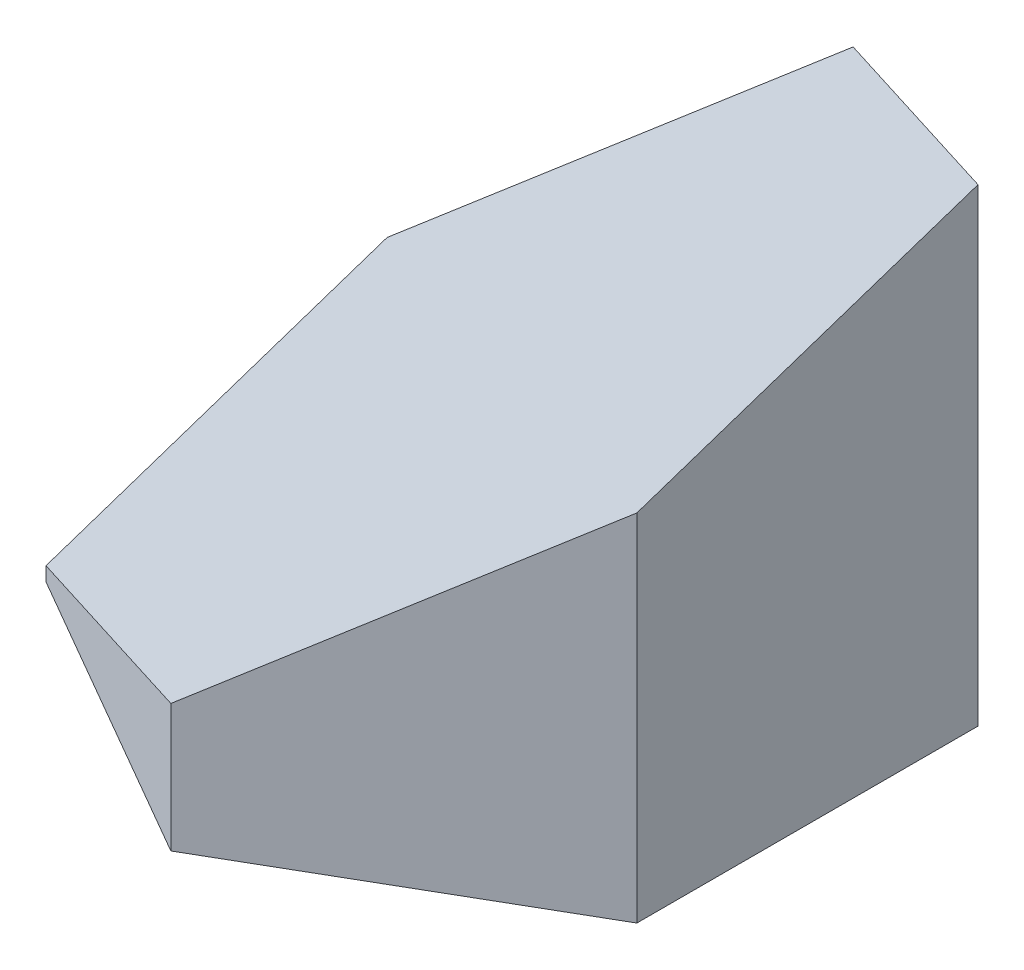
ISO-10303-21;
HEADER;
FILE_DESCRIPTION(('STEP AP214'),'2;1');
FILE_NAME('part.step','',(''),(''),'','','');
FILE_SCHEMA(('AUTOMOTIVE_DESIGN { 1 0 10303 214 1 1 1 1 }'));
ENDSEC;
DATA;
#1=APPLICATION_CONTEXT('core data for automotive mechanical design processes');
#2=APPLICATION_PROTOCOL_DEFINITION('international standard','automotive_design',2000,#1);
#3=PRODUCT_CONTEXT('',#1,'mechanical');
#4=PRODUCT('Part','Part','',(#3));
#5=PRODUCT_RELATED_PRODUCT_CATEGORY('part','',(#4));
#6=PRODUCT_DEFINITION_FORMATION('','',#4);
#7=PRODUCT_DEFINITION_CONTEXT('part definition',#1,'design');
#8=PRODUCT_DEFINITION('design','',#6,#7);
#9=PRODUCT_DEFINITION_SHAPE('','',#8);
#10=(LENGTH_UNIT() NAMED_UNIT(*) SI_UNIT(.MILLI.,.METRE.));
#11=(NAMED_UNIT(*) PLANE_ANGLE_UNIT() SI_UNIT($,.RADIAN.));
#12=(NAMED_UNIT(*) SI_UNIT($,.STERADIAN.) SOLID_ANGLE_UNIT());
#13=UNCERTAINTY_MEASURE_WITH_UNIT(LENGTH_MEASURE(1.E-05),#10,'distance_accuracy_value','');
#14=(GEOMETRIC_REPRESENTATION_CONTEXT(3) GLOBAL_UNCERTAINTY_ASSIGNED_CONTEXT((#13)) GLOBAL_UNIT_ASSIGNED_CONTEXT((#10,
#11,#12)) REPRESENTATION_CONTEXT('',''));
#15=CARTESIAN_POINT('',(0.,0.,0.));
#16=DIRECTION('',(0.,0.,1.));
#17=DIRECTION('',(1.,0.,0.));
#18=AXIS2_PLACEMENT_3D('',#15,#16,#17);
#19=CARTESIAN_POINT('',(0.,0.,0.));
#20=DIRECTION('',(0.480384461415263,-0.832050294337843,-0.277350098112614));
#21=DIRECTION('',(0.866025403784438,0.500000000000001,0.));
#22=AXIS2_PLACEMENT_3D('',#19,#20,#21);
#23=PLANE('',#22);
#24=DIRECTION('',(-0.72057669212289,-0.55470019622523,0.416025147168924));
#25=VECTOR('',#24,1.);
#26=CARTESIAN_POINT('',(109.626508050868,38.0636045401386,75.6878681800464));
#27=LINE('',#26,#25);
#28=CARTESIAN_POINT('',(114.282032302755,41.6474287801999,73.0000000000004));
#29=VERTEX_POINT('',#28);
#30=CARTESIAN_POINT('',(79.6410161513778,14.9807621135334,93.0000000000003));
#31=VERTEX_POINT('',#30);
#32=EDGE_CURVE('E87',#29,#31,#27,.T.);
#33=ORIENTED_EDGE('',*,*,#32,.F.);
#34=DIRECTION('',(0.,-0.316227766016837,0.948683298050514));
#35=VECTOR('',#34,1.);
#36=CARTESIAN_POINT('',(114.282032302755,46.4826859021799,58.4942286340604));
#37=LINE('',#36,#35);
#38=CARTESIAN_POINT('',(114.282032302755,54.9807621135333,33.));
#39=VERTEX_POINT('',#38);
#40=EDGE_CURVE('E93',#39,#29,#37,.T.);
#41=ORIENTED_EDGE('',*,*,#40,.F.);
#42=DIRECTION('',(0.821583836257748,0.316227766016838,0.474341649025259));
#43=VECTOR('',#42,1.);
#44=CARTESIAN_POINT('',(123.38029719201,58.48268590218,38.2528856829701));
#45=LINE('',#44,#43);
#46=CARTESIAN_POINT('',(79.6410161513775,41.6474287802,13.));
#47=VERTEX_POINT('',#46);
#48=EDGE_CURVE('E143',#47,#39,#45,.T.);
#49=ORIENTED_EDGE('',*,*,#48,.F.);
#50=DIRECTION('',(0.720576692122891,0.55470019622523,-0.416025147168922));
#51=VECTOR('',#50,1.);
#52=CARTESIAN_POINT('',(98.9677338504436,56.525143001677,1.84171433389228));
#53=LINE('',#52,#51);
#54=CARTESIAN_POINT('',(45.,14.9807621135333,33.));
#55=VERTEX_POINT('',#54);
#56=EDGE_CURVE('E139',#55,#47,#53,.T.);
#57=ORIENTED_EDGE('',*,*,#56,.F.);
#58=DIRECTION('',(0.,0.316227766016837,-0.948683298050514));
#59=VECTOR('',#58,1.);
#60=CARTESIAN_POINT('',(45.,22.4826859021799,10.4942286340601));
#61=LINE('',#60,#59);
#62=CARTESIAN_POINT('',(45.,1.64742878019996,73.0000000000001));
#63=VERTEX_POINT('',#62);
#64=EDGE_CURVE('E51',#63,#55,#61,.T.);
#65=ORIENTED_EDGE('',*,*,#64,.F.);
#66=DIRECTION('',(-0.821583836257748,-0.316227766016839,-0.474341649025259));
#67=VECTOR('',#66,1.);
#68=CARTESIAN_POINT('',(67.9546713498062,10.48268590218,86.2528856829702));
#69=LINE('',#68,#67);
#70=EDGE_CURVE('E12',#31,#63,#69,.T.);
#71=ORIENTED_EDGE('',*,*,#70,.F.);
#72=EDGE_LOOP('',(#33,#41,#49,#57,#65,#71));
#73=FACE_BOUND('',#72,.T.);
#74=ADVANCED_FACE('F36',(#73),#23,.F.);
#75=CARTESIAN_POINT('',(79.6410161513778,90.,93.0000000000003));
#76=DIRECTION('',(-0.500000000000002,0.,-0.866025403784437));
#77=DIRECTION('',(-0.866025403784437,0.,0.500000000000003));
#78=AXIS2_PLACEMENT_3D('',#75,#76,#77);
#79=PLANE('',#78);
#80=DIRECTION('',(0.,-1.,0.));
#81=VECTOR('',#80,1.);
#82=CARTESIAN_POINT('',(114.282032302755,90.,73.0000000000004));
#83=LINE('',#82,#81);
#84=CARTESIAN_POINT('',(114.282032302755,0.,73.0000000000004));
#85=VERTEX_POINT('',#84);
#86=EDGE_CURVE('E44',#29,#85,#83,.T.);
#87=ORIENTED_EDGE('',*,*,#86,.F.);
#88=ORIENTED_EDGE('',*,*,#32,.T.);
#89=DIRECTION('',(0.,-1.,0.));
#90=VECTOR('',#89,1.);
#91=CARTESIAN_POINT('',(79.6410161513778,90.,93.0000000000003));
#92=LINE('',#91,#90);
#93=CARTESIAN_POINT('',(79.6410161513778,0.,93.0000000000003));
#94=VERTEX_POINT('',#93);
#95=EDGE_CURVE('E58',#31,#94,#92,.T.);
#96=ORIENTED_EDGE('',*,*,#95,.T.);
#97=DIRECTION('',(0.866025403784437,0.,-0.500000000000002));
#98=VECTOR('',#97,1.);
#99=CARTESIAN_POINT('',(79.6410161513778,0.,93.0000000000003));
#100=LINE('',#99,#98);
#101=EDGE_CURVE('E92',#94,#85,#100,.T.);
#102=ORIENTED_EDGE('',*,*,#101,.T.);
#103=EDGE_LOOP('',(#87,#88,#96,#102));
#104=FACE_BOUND('',#103,.T.);
#105=ADVANCED_FACE('F38',(#104),#79,.F.);
#106=CARTESIAN_POINT('',(114.282032302755,90.,73.0000000000004));
#107=DIRECTION('',(-1.,0.,0.));
#108=DIRECTION('',(0.,0.,1.));
#109=AXIS2_PLACEMENT_3D('',#106,#107,#108);
#110=PLANE('',#109);
#111=DIRECTION('',(0.,-1.,0.));
#112=VECTOR('',#111,1.);
#113=CARTESIAN_POINT('',(114.282032302755,90.,33.));
#114=LINE('',#113,#112);
#115=CARTESIAN_POINT('',(114.282032302755,0.,33.));
#116=VERTEX_POINT('',#115);
#117=EDGE_CURVE('E110',#39,#116,#114,.T.);
#118=ORIENTED_EDGE('',*,*,#117,.F.);
#119=ORIENTED_EDGE('',*,*,#40,.T.);
#120=ORIENTED_EDGE('',*,*,#86,.T.);
#121=DIRECTION('',(0.,0.,-1.));
#122=VECTOR('',#121,1.);
#123=CARTESIAN_POINT('',(114.282032302755,0.,73.0000000000004));
#124=LINE('',#123,#122);
#125=EDGE_CURVE('E116',#85,#116,#124,.T.);
#126=ORIENTED_EDGE('',*,*,#125,.T.);
#127=EDGE_LOOP('',(#118,#119,#120,#126));
#128=FACE_BOUND('',#127,.T.);
#129=ADVANCED_FACE('F115',(#128),#110,.F.);
#130=CARTESIAN_POINT('',(114.282032302755,90.,33.));
#131=DIRECTION('',(-0.500000000000002,0.,0.866025403784437));
#132=DIRECTION('',(0.866025403784437,0.,0.500000000000002));
#133=AXIS2_PLACEMENT_3D('',#130,#131,#132);
#134=PLANE('',#133);
#135=DIRECTION('',(0.,-1.,0.));
#136=VECTOR('',#135,1.);
#137=CARTESIAN_POINT('',(79.6410161513775,90.,13.));
#138=LINE('',#137,#136);
#139=CARTESIAN_POINT('',(79.6410161513775,0.,13.));
#140=VERTEX_POINT('',#139);
#141=EDGE_CURVE('E108',#47,#140,#138,.T.);
#142=ORIENTED_EDGE('',*,*,#141,.F.);
#143=ORIENTED_EDGE('',*,*,#48,.T.);
#144=ORIENTED_EDGE('',*,*,#117,.T.);
#145=DIRECTION('',(-0.866025403784437,0.,-0.500000000000002));
#146=VECTOR('',#145,1.);
#147=CARTESIAN_POINT('',(114.282032302755,0.,33.));
#148=LINE('',#147,#146);
#149=EDGE_CURVE('E122',#116,#140,#148,.T.);
#150=ORIENTED_EDGE('',*,*,#149,.T.);
#151=EDGE_LOOP('',(#142,#143,#144,#150));
#152=FACE_BOUND('',#151,.T.);
#153=ADVANCED_FACE('F142',(#152),#134,.F.);
#154=CARTESIAN_POINT('',(79.6410161513775,90.,13.));
#155=DIRECTION('',(0.500000000000001,0.,0.866025403784438));
#156=DIRECTION('',(0.866025403784438,0.,-0.500000000000001));
#157=AXIS2_PLACEMENT_3D('',#154,#155,#156);
#158=PLANE('',#157);
#159=DIRECTION('',(0.,-1.,0.));
#160=VECTOR('',#159,1.);
#161=CARTESIAN_POINT('',(45.,90.,33.));
#162=LINE('',#161,#160);
#163=CARTESIAN_POINT('',(45.,0.,33.));
#164=VERTEX_POINT('',#163);
#165=EDGE_CURVE('E101',#55,#164,#162,.T.);
#166=ORIENTED_EDGE('',*,*,#165,.F.);
#167=ORIENTED_EDGE('',*,*,#56,.T.);
#168=ORIENTED_EDGE('',*,*,#141,.T.);
#169=DIRECTION('',(-0.866025403784438,0.,0.500000000000001));
#170=VECTOR('',#169,1.);
#171=CARTESIAN_POINT('',(79.6410161513775,0.,13.));
#172=LINE('',#171,#170);
#173=EDGE_CURVE('E128',#140,#164,#172,.T.);
#174=ORIENTED_EDGE('',*,*,#173,.T.);
#175=EDGE_LOOP('',(#166,#167,#168,#174));
#176=FACE_BOUND('',#175,.T.);
#177=ADVANCED_FACE('F136',(#176),#158,.F.);
#178=CARTESIAN_POINT('',(45.,90.,33.));
#179=DIRECTION('',(1.,0.,0.));
#180=DIRECTION('',(0.,0.,-1.));
#181=AXIS2_PLACEMENT_3D('',#178,#179,#180);
#182=PLANE('',#181);
#183=DIRECTION('',(0.,-1.,0.));
#184=VECTOR('',#183,1.);
#185=CARTESIAN_POINT('',(45.,90.,73.0000000000001));
#186=LINE('',#185,#184);
#187=CARTESIAN_POINT('',(45.,0.,73.0000000000001));
#188=VERTEX_POINT('',#187);
#189=EDGE_CURVE('E99',#63,#188,#186,.T.);
#190=ORIENTED_EDGE('',*,*,#189,.F.);
#191=ORIENTED_EDGE('',*,*,#64,.T.);
#192=ORIENTED_EDGE('',*,*,#165,.T.);
#193=DIRECTION('',(0.,0.,1.));
#194=VECTOR('',#193,1.);
#195=CARTESIAN_POINT('',(45.,0.,33.));
#196=LINE('',#195,#194);
#197=EDGE_CURVE('E103',#164,#188,#196,.T.);
#198=ORIENTED_EDGE('',*,*,#197,.T.);
#199=EDGE_LOOP('',(#190,#191,#192,#198));
#200=FACE_BOUND('',#199,.T.);
#201=ADVANCED_FACE('F133',(#200),#182,.F.);
#202=CARTESIAN_POINT('',(45.,90.,73.0000000000001));
#203=DIRECTION('',(0.500000000000002,0.,-0.866025403784437));
#204=DIRECTION('',(-0.866025403784438,0.,-0.500000000000002));
#205=AXIS2_PLACEMENT_3D('',#202,#203,#204);
#206=PLANE('',#205);
#207=ORIENTED_EDGE('',*,*,#95,.F.);
#208=ORIENTED_EDGE('',*,*,#70,.T.);
#209=ORIENTED_EDGE('',*,*,#189,.T.);
#210=DIRECTION('',(0.866025403784437,0.,0.500000000000002));
#211=VECTOR('',#210,1.);
#212=CARTESIAN_POINT('',(45.,0.,73.0000000000001));
#213=LINE('',#212,#211);
#214=EDGE_CURVE('E97',#188,#94,#213,.T.);
#215=ORIENTED_EDGE('',*,*,#214,.T.);
#216=EDGE_LOOP('',(#207,#208,#209,#215));
#217=FACE_BOUND('',#216,.T.);
#218=ADVANCED_FACE('F95',(#217),#206,.F.);
#219=CARTESIAN_POINT('',(0.,0.,0.));
#220=DIRECTION('',(0.,1.,0.));
#221=DIRECTION('',(0.,0.,1.));
#222=AXIS2_PLACEMENT_3D('',#219,#220,#221);
#223=PLANE('',#222);
#224=ORIENTED_EDGE('',*,*,#101,.F.);
#225=ORIENTED_EDGE('',*,*,#214,.F.);
#226=ORIENTED_EDGE('',*,*,#197,.F.);
#227=ORIENTED_EDGE('',*,*,#173,.F.);
#228=ORIENTED_EDGE('',*,*,#149,.F.);
#229=ORIENTED_EDGE('',*,*,#125,.F.);
#230=EDGE_LOOP('',(#224,#225,#226,#227,#228,#229));
#231=FACE_BOUND('',#230,.T.);
#232=ADVANCED_FACE('F119',(#231),#223,.F.);
#233=CLOSED_SHELL('',(#74,#105,#129,#153,#177,#201,#218,#232));
#234=MANIFOLD_SOLID_BREP('B2',#233);
#235=ADVANCED_BREP_SHAPE_REPRESENTATION('',(#18,#234),#14);
#236=SHAPE_DEFINITION_REPRESENTATION(#9,#235);
ENDSEC;
END-ISO-10303-21;
